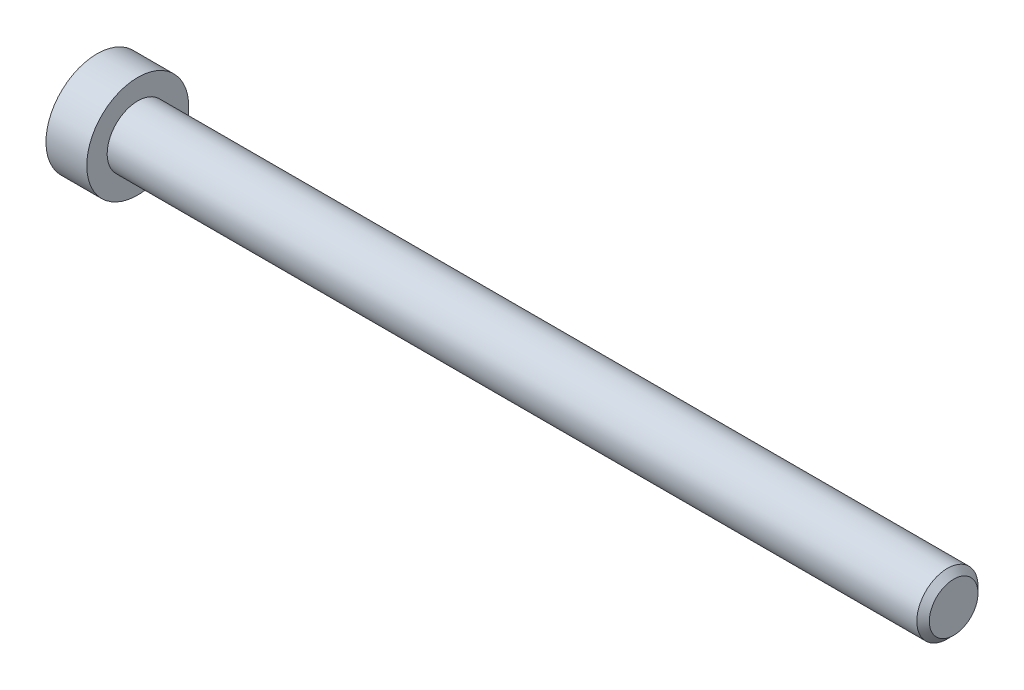
ISO-10303-21;
HEADER;
FILE_DESCRIPTION(('STEP AP214'),'2;1');
FILE_NAME('part.step','',(''),(''),'','','');
FILE_SCHEMA(('AUTOMOTIVE_DESIGN { 1 0 10303 214 1 1 1 1 }'));
ENDSEC;
DATA;
#1=APPLICATION_CONTEXT('core data for automotive mechanical design processes');
#2=APPLICATION_PROTOCOL_DEFINITION('international standard','automotive_design',2000,#1);
#3=PRODUCT_CONTEXT('',#1,'mechanical');
#4=PRODUCT('Part','Part','',(#3));
#5=PRODUCT_RELATED_PRODUCT_CATEGORY('part','',(#4));
#6=PRODUCT_DEFINITION_FORMATION('','',#4);
#7=PRODUCT_DEFINITION_CONTEXT('part definition',#1,'design');
#8=PRODUCT_DEFINITION('design','',#6,#7);
#9=PRODUCT_DEFINITION_SHAPE('','',#8);
#10=(LENGTH_UNIT() NAMED_UNIT(*) SI_UNIT(.MILLI.,.METRE.));
#11=(NAMED_UNIT(*) PLANE_ANGLE_UNIT() SI_UNIT($,.RADIAN.));
#12=(NAMED_UNIT(*) SI_UNIT($,.STERADIAN.) SOLID_ANGLE_UNIT());
#13=UNCERTAINTY_MEASURE_WITH_UNIT(LENGTH_MEASURE(1.E-05),#10,'distance_accuracy_value','');
#14=(GEOMETRIC_REPRESENTATION_CONTEXT(3) GLOBAL_UNCERTAINTY_ASSIGNED_CONTEXT((#13)) GLOBAL_UNIT_ASSIGNED_CONTEXT((#10,
#11,#12)) REPRESENTATION_CONTEXT('',''));
#15=CARTESIAN_POINT('',(0.,0.,0.));
#16=DIRECTION('',(0.,0.,1.));
#17=DIRECTION('',(1.,0.,0.));
#18=AXIS2_PLACEMENT_3D('',#15,#16,#17);
#19=CARTESIAN_POINT('',(0.999999999066858,0.,0.));
#20=DIRECTION('',(-1.,0.,0.));
#21=DIRECTION('',(0.,0.,1.));
#22=AXIS2_PLACEMENT_3D('',#19,#20,#21);
#23=CONICAL_SURFACE('',#22,1.49999999950978,1.04719755001518);
#24=CARTESIAN_POINT('',(1.86602540486547,1.13686837721616E-10,0.));
#25=VERTEX_POINT('',#24);
#26=VERTEX_LOOP('',#25);
#27=FACE_BOUND('',#26,.T.);
#28=CARTESIAN_POINT('',(1.,0.,0.));
#29=DIRECTION('',(1.,0.,0.));
#30=DIRECTION('',(0.,1.,0.));
#31=AXIS2_PLACEMENT_3D('',#28,#29,#30);
#32=CIRCLE('',#31,1.5);
#33=CARTESIAN_POINT('',(1.,1.5,0.));
#34=VERTEX_POINT('',#33);
#35=EDGE_CURVE('E102',#34,#34,#32,.F.);
#36=ORIENTED_EDGE('',*,*,#35,.T.);
#37=EDGE_LOOP('',(#36));
#38=FACE_BOUND('',#37,.T.);
#39=ADVANCED_FACE('F15',(#27,#38),#23,.F.);
#40=CARTESIAN_POINT('',(0.150320631441119,0.,0.));
#41=DIRECTION('',(1.,0.,0.));
#42=DIRECTION('',(0.,1.,0.));
#43=AXIS2_PLACEMENT_3D('',#40,#41,#42);
#44=CYLINDRICAL_SURFACE('',#43,1.5);
#45=ORIENTED_EDGE('',*,*,#35,.F.);
#46=EDGE_LOOP('',(#45));
#47=FACE_BOUND('',#46,.T.);
#48=CARTESIAN_POINT('',(-0.699358736312661,0.,0.));
#49=DIRECTION('',(-1.,0.,0.));
#50=DIRECTION('',(0.,1.,0.));
#51=AXIS2_PLACEMENT_3D('',#48,#49,#50);
#52=CIRCLE('',#51,1.50000000047612);
#53=CARTESIAN_POINT('',(-0.699358736312661,1.50000000047612,0.));
#54=VERTEX_POINT('',#53);
#55=EDGE_CURVE('E83',#54,#54,#52,.T.);
#56=ORIENTED_EDGE('',*,*,#55,.T.);
#57=EDGE_LOOP('',(#56));
#58=FACE_BOUND('',#57,.T.);
#59=ADVANCED_FACE('F152',(#47,#58),#44,.F.);
#60=CARTESIAN_POINT('',(-1.50480384832008,0.,0.));
#61=DIRECTION('',(-1.,0.,0.));
#62=DIRECTION('',(0.,0.,1.));
#63=AXIS2_PLACEMENT_3D('',#60,#61,#62);
#64=CONICAL_SURFACE('',#63,2.89507185334514,1.04719755001073);
#65=ORIENTED_EDGE('',*,*,#55,.F.);
#66=EDGE_LOOP('',(#65));
#67=FACE_BOUND('',#66,.T.);
#68=CARTESIAN_POINT('',(-1.50000000090994,2.50000000020726,1.44337567271138));
#69=CARTESIAN_POINT('',(-1.46336943230046,2.50000000007444,1.31652043381892));
#70=CARTESIAN_POINT('',(-1.4300558472106,2.50000000001995,1.18857018231563));
#71=CARTESIAN_POINT('',(-1.37190798495513,2.49999999998001,0.930454306290177));
#72=CARTESIAN_POINT('',(-1.34709427605387,2.49999999999471,0.800284097041287));
#73=CARTESIAN_POINT('',(-1.30846994921723,2.50000000000517,0.541556812697644));
#74=CARTESIAN_POINT('',(-1.29440223500533,2.50000000000138,0.413039534960997));
#75=CARTESIAN_POINT('',(-1.27761146065546,2.49999999999863,0.155400578725887));
#76=CARTESIAN_POINT('',(-1.27487449296861,2.49999999999966,0.0262798360324409));
#77=CARTESIAN_POINT('',(-1.28058286324248,2.5000000000003,-0.214968419856101));
#78=CARTESIAN_POINT('',(-1.28762660709737,2.50000000000009,-0.327132134317981));
#79=CARTESIAN_POINT('',(-1.30994662654135,2.49999999999992,-0.550728853225329));
#80=CARTESIAN_POINT('',(-1.32523051914313,2.49999999999998,-0.662161084886667));
#81=CARTESIAN_POINT('',(-1.36343729244334,2.50000000000003,-0.886218434121961));
#82=CARTESIAN_POINT('',(-1.38652205359365,2.50000000000002,-0.998815208519759));
#83=CARTESIAN_POINT('',(-1.43891470197747,2.49999999999999,-1.22232986213441));
#84=CARTESIAN_POINT('',(-1.46821028692561,2.49999999999998,-1.33325060262345));
#85=CARTESIAN_POINT('',(-1.50000000104471,2.5,-1.44337567270819));
#86=B_SPLINE_CURVE_WITH_KNOTS('',3,(#68,#69,#70,#71,#72,#73,#74,#75,#76,#77,#78,#79,#80,#81,#82,
#83,#84,#85),.UNSPECIFIED.,.F.,.F.,(4,2,2,2,2,2,2,2,4),(0.,0.39627001456981,0.793492271541644,
1.18088450803327,1.56780111154381,1.9046347285053,2.2417802422547,2.58640202794493,
2.93034746654568),.UNSPECIFIED.);
#87=CARTESIAN_POINT('',(-1.5000000010352,2.4999999998706,1.44337567289935));
#88=VERTEX_POINT('',#87);
#89=CARTESIAN_POINT('',(-1.50000000107833,2.5,-1.44337567282465));
#90=VERTEX_POINT('',#89);
#91=EDGE_CURVE('E18',#88,#90,#86,.T.);
#92=ORIENTED_EDGE('',*,*,#91,.T.);
#93=CARTESIAN_POINT('',(-1.50000000090994,2.49999999987614,-1.4433756732849));
#94=CARTESIAN_POINT('',(-1.46336943230046,2.39014014032572,-1.5068032926161));
#95=CARTESIAN_POINT('',(-1.4300558472106,2.27933197207602,-1.57077841832056));
#96=CARTESIAN_POINT('',(-1.37190798495513,2.05579706629793,-1.69983635629869));
#97=CARTESIAN_POINT('',(-1.34709427605387,1.9430663582798,-1.76492146093587));
#98=CARTESIAN_POINT('',(-1.30846994921723,1.71900195739128,-1.89428510311675));
#99=CARTESIAN_POINT('',(-1.29440223500533,1.60770273004423,-1.95854374198179));
#100=CARTESIAN_POINT('',(-1.27761146065546,1.38458084893874,-2.08736322009696));
#101=CARTESIAN_POINT('',(-1.27487449296861,1.27275900561122,-2.15192359144458));
#102=CARTESIAN_POINT('',(-1.28058286324248,1.06383188739337,-2.27254771938941));
#103=CARTESIAN_POINT('',(-1.28762660709736,0.966695261286451,-2.32862957662016));
#104=CARTESIAN_POINT('',(-1.30994662654135,0.773054822509758,-2.44042793607369));
#105=CARTESIAN_POINT('',(-1.32523051914313,0.676551679090675,-2.49614405190441));
#106=CARTESIAN_POINT('',(-1.36343729244334,0.482512322748331,-2.6081727265221));
#107=CARTESIAN_POINT('',(-1.38652205359365,0.385000655735647,-2.66447111372099));
#108=CARTESIAN_POINT('',(-1.43891470197746,0.191431287587271,-2.77622844052829));
#109=CARTESIAN_POINT('',(-1.4682102869256,0.095371108517176,-2.8316888107728));
#110=CARTESIAN_POINT('',(-1.50000000104471,2.30253922132991E-10,-2.88675134581519));
#111=B_SPLINE_CURVE_WITH_KNOTS('',3,(#93,#94,#95,#96,#97,#98,#99,#100,#101,#102,#103,#104,#105,
#106,#107,#108,#109,#110),.UNSPECIFIED.,.F.,.F.,(4,2,2,2,2,2,2,2,4),(0.,0.39627001456981,
0.793492271541645,1.18088450803327,1.56780111154381,1.9046347285053,2.2417802422547,
2.58640202794493,2.93034746654569),.UNSPECIFIED.);
#112=CARTESIAN_POINT('',(-1.5000000010352,0.,-2.88675134579871));
#113=VERTEX_POINT('',#112);
#114=EDGE_CURVE('E107',#90,#113,#111,.T.);
#115=ORIENTED_EDGE('',*,*,#114,.T.);
#116=CARTESIAN_POINT('',(-1.50000000090994,-3.31114457490151E-10,-2.88675134599628));
#117=CARTESIAN_POINT('',(-1.46336943230046,-0.109859859748714,-2.82332372643503));
#118=CARTESIAN_POINT('',(-1.4300558472106,-0.220668027943928,-2.75934860063619));
#119=CARTESIAN_POINT('',(-1.37190798495513,-0.444202933682073,-2.63029066258887));
#120=CARTESIAN_POINT('',(-1.34709427605387,-0.5569336417149,-2.56520555797716));
#121=CARTESIAN_POINT('',(-1.30846994921723,-0.780998042613884,-2.43584191581439));
#122=CARTESIAN_POINT('',(-1.29440223500533,-0.892297269957147,-2.37158327694279));
#123=CARTESIAN_POINT('',(-1.27761146065546,-1.11541915105988,-2.24276379882285));
#124=CARTESIAN_POINT('',(-1.27487449296861,-1.22724099438844,-2.17820342747702));
#125=CARTESIAN_POINT('',(-1.28058286324248,-1.43616811260693,-2.05757929953331));
#126=CARTESIAN_POINT('',(-1.28762660709736,-1.53330473871363,-2.00149744230218));
#127=CARTESIAN_POINT('',(-1.30994662654135,-1.72694517749016,-1.88969908284837));
#128=CARTESIAN_POINT('',(-1.32523051914313,-1.8234483209093,-1.83398296701775));
#129=CARTESIAN_POINT('',(-1.36343729244334,-2.01748767725169,-1.72195429240014));
#130=CARTESIAN_POINT('',(-1.38652205359365,-2.11499934426437,-1.66565590520123));
#131=CARTESIAN_POINT('',(-1.43891470197746,-2.30856871241272,-1.55389857839388));
#132=CARTESIAN_POINT('',(-1.4682102869256,-2.4046288914828,-1.49843820814935));
#133=CARTESIAN_POINT('',(-1.50000000104471,-2.49999999976975,-1.443375673107));
#134=B_SPLINE_CURVE_WITH_KNOTS('',3,(#116,#117,#118,#119,#120,#121,#122,#123,#124,#125,#126,
#127,#128,#129,#130,#131,#132,#133),.UNSPECIFIED.,.F.,.F.,(4,2,2,2,2,2,2,2,4),(0.,
0.396270014569809,0.793492271541644,1.18088450803327,1.56780111154381,1.9046347285053,
2.2417802422547,2.58640202794493,2.93034746654569),.UNSPECIFIED.);
#135=CARTESIAN_POINT('',(-1.5000000010352,-2.4999999998706,-1.44337567289936));
#136=VERTEX_POINT('',#135);
#137=EDGE_CURVE('E141',#113,#136,#134,.T.);
#138=ORIENTED_EDGE('',*,*,#137,.T.);
#139=CARTESIAN_POINT('',(-1.50000000090994,-2.50000000020726,-1.44337567271139));
#140=CARTESIAN_POINT('',(-1.46336943230046,-2.50000000007444,-1.31652043381893));
#141=CARTESIAN_POINT('',(-1.4300558472106,-2.50000000001995,-1.18857018231564));
#142=CARTESIAN_POINT('',(-1.37190798495513,-2.49999999998,-0.930454306290184));
#143=CARTESIAN_POINT('',(-1.34709427605387,-2.49999999999471,-0.800284097041294));
#144=CARTESIAN_POINT('',(-1.30846994921723,-2.50000000000516,-0.541556812697651));
#145=CARTESIAN_POINT('',(-1.29440223500533,-2.50000000000138,-0.413039534961004));
#146=CARTESIAN_POINT('',(-1.27761146065546,-2.49999999999863,-0.155400578725895));
#147=CARTESIAN_POINT('',(-1.27487449296861,-2.49999999999966,-0.0262798360324483));
#148=CARTESIAN_POINT('',(-1.28058286324248,-2.5000000000003,0.214968419856093));
#149=CARTESIAN_POINT('',(-1.28762660709736,-2.50000000000008,0.327132134317974));
#150=CARTESIAN_POINT('',(-1.30994662654135,-2.49999999999992,0.550728853225323));
#151=CARTESIAN_POINT('',(-1.32523051914313,-2.49999999999998,0.662161084886662));
#152=CARTESIAN_POINT('',(-1.36343729244334,-2.50000000000002,0.886218434121957));
#153=CARTESIAN_POINT('',(-1.38652205359365,-2.50000000000001,0.998815208519755));
#154=CARTESIAN_POINT('',(-1.43891470197746,-2.49999999999999,1.2223298621344));
#155=CARTESIAN_POINT('',(-1.4682102869256,-2.49999999999998,1.33325060262344));
#156=CARTESIAN_POINT('',(-1.50000000104471,-2.5,1.44337567270819));
#157=B_SPLINE_CURVE_WITH_KNOTS('',3,(#139,#140,#141,#142,#143,#144,#145,#146,#147,#148,#149,
#150,#151,#152,#153,#154,#155,#156),.UNSPECIFIED.,.F.,.F.,(4,2,2,2,2,2,2,2,4),(0.,
0.396270014569809,0.793492271541644,1.18088450803327,1.56780111154381,1.9046347285053,
2.2417802422547,2.58640202794493,2.93034746654569),.UNSPECIFIED.);
#158=CARTESIAN_POINT('',(-1.5000000010352,-2.4999999998706,1.44337567289936));
#159=VERTEX_POINT('',#158);
#160=EDGE_CURVE('E165',#136,#159,#157,.T.);
#161=ORIENTED_EDGE('',*,*,#160,.T.);
#162=CARTESIAN_POINT('',(-1.50000000090994,-2.49999999987614,1.44337567328489));
#163=CARTESIAN_POINT('',(-1.46336943230046,-2.39014014032572,1.5068032926161));
#164=CARTESIAN_POINT('',(-1.4300558472106,-2.27933197207602,1.57077841832055));
#165=CARTESIAN_POINT('',(-1.37190798495513,-2.05579706629793,1.69983635629869));
#166=CARTESIAN_POINT('',(-1.34709427605387,-1.9430663582798,1.76492146093586));
#167=CARTESIAN_POINT('',(-1.30846994921723,-1.71900195739128,1.89428510311674));
#168=CARTESIAN_POINT('',(-1.29440223500533,-1.60770273004423,1.95854374198179));
#169=CARTESIAN_POINT('',(-1.27761146065546,-1.38458084893874,2.08736322009696));
#170=CARTESIAN_POINT('',(-1.27487449296861,-1.27275900561122,2.15192359144457));
#171=CARTESIAN_POINT('',(-1.28058286324248,-1.06383188739337,2.2725477193894));
#172=CARTESIAN_POINT('',(-1.28762660709736,-0.966695261286452,2.32862957662015));
#173=CARTESIAN_POINT('',(-1.30994662654135,-0.773054822509759,2.44042793607369));
#174=CARTESIAN_POINT('',(-1.32523051914313,-0.676551679090675,2.49614405190441));
#175=CARTESIAN_POINT('',(-1.36343729244334,-0.482512322748331,2.6081727265221));
#176=CARTESIAN_POINT('',(-1.38652205359365,-0.385000655735646,2.66447111372098));
#177=CARTESIAN_POINT('',(-1.43891470197746,-0.19143128758727,2.77622844052829));
#178=CARTESIAN_POINT('',(-1.4682102869256,-0.0953711085171749,2.8316888107728));
#179=CARTESIAN_POINT('',(-1.50000000104471,-2.30252668835411E-10,2.88675134581519));
#180=B_SPLINE_CURVE_WITH_KNOTS('',3,(#162,#163,#164,#165,#166,#167,#168,#169,#170,#171,#172,
#173,#174,#175,#176,#177,#178,#179),.UNSPECIFIED.,.F.,.F.,(4,2,2,2,2,2,2,2,4),(0.,
0.396270014569809,0.793492271541644,1.18088450803327,1.56780111154381,1.9046347285053,
2.2417802422547,2.58640202794493,2.93034746654569),.UNSPECIFIED.);
#181=CARTESIAN_POINT('',(-1.5000000010352,0.,2.88675134579871));
#182=VERTEX_POINT('',#181);
#183=EDGE_CURVE('E88',#159,#182,#180,.T.);
#184=ORIENTED_EDGE('',*,*,#183,.T.);
#185=CARTESIAN_POINT('',(-1.50000000090994,3.31115352694269E-10,2.88675134599628));
#186=CARTESIAN_POINT('',(-1.46336943230046,0.109859859748716,2.82332372643503));
#187=CARTESIAN_POINT('',(-1.4300558472106,0.220668027943929,2.75934860063619));
#188=CARTESIAN_POINT('',(-1.37190798495513,0.444202933682074,2.63029066258887));
#189=CARTESIAN_POINT('',(-1.34709427605387,0.556933641714901,2.56520555797716));
#190=CARTESIAN_POINT('',(-1.30846994921723,0.780998042613885,2.43584191581439));
#191=CARTESIAN_POINT('',(-1.29440223500533,0.892297269957148,2.37158327694279));
#192=CARTESIAN_POINT('',(-1.27761146065546,1.11541915105988,2.24276379882285));
#193=CARTESIAN_POINT('',(-1.27487449296861,1.22724099438844,2.17820342747702));
#194=CARTESIAN_POINT('',(-1.28058286324248,1.43616811260693,2.05757929953331));
#195=CARTESIAN_POINT('',(-1.28762660709736,1.53330473871363,2.00149744230218));
#196=CARTESIAN_POINT('',(-1.30994662654135,1.72694517749016,1.88969908284836));
#197=CARTESIAN_POINT('',(-1.32523051914313,1.8234483209093,1.83398296701774));
#198=CARTESIAN_POINT('',(-1.36343729244334,2.01748767725169,1.72195429240013));
#199=CARTESIAN_POINT('',(-1.38652205359365,2.11499934426437,1.66565590520122));
#200=CARTESIAN_POINT('',(-1.43891470197746,2.30856871241272,1.55389857839388));
#201=CARTESIAN_POINT('',(-1.4682102869256,2.40462889148281,1.49843820814935));
#202=CARTESIAN_POINT('',(-1.50000000104471,2.49999999976975,1.44337567310699));
#203=B_SPLINE_CURVE_WITH_KNOTS('',3,(#185,#186,#187,#188,#189,#190,#191,#192,#193,#194,#195,
#196,#197,#198,#199,#200,#201,#202),.UNSPECIFIED.,.F.,.F.,(4,2,2,2,2,2,2,2,4),(0.,
0.39627001456981,0.793492271541644,1.18088450803327,1.56780111154381,1.9046347285053,
2.2417802422547,2.58640202794494,2.9303474665457),.UNSPECIFIED.);
#204=EDGE_CURVE('E85',#182,#88,#203,.T.);
#205=ORIENTED_EDGE('',*,*,#204,.T.);
#206=EDGE_LOOP('',(#92,#115,#138,#161,#184,#205));
#207=FACE_BOUND('',#206,.T.);
#208=ADVANCED_FACE('F86',(#67,#207),#64,.F.);
#209=CARTESIAN_POINT('',(-3.99999999999999,2.5,1.44337567297406));
#210=DIRECTION('',(0.,1.,0.));
#211=DIRECTION('',(0.,0.,1.));
#212=AXIS2_PLACEMENT_3D('',#209,#210,#211);
#213=PLANE('',#212);
#214=DIRECTION('',(1.,0.,0.));
#215=VECTOR('',#214,1.);
#216=CARTESIAN_POINT('',(-3.99999999999999,2.5,1.44337567297406));
#217=LINE('',#216,#215);
#218=CARTESIAN_POINT('',(-3.99999999999999,2.5,1.44337567297406));
#219=VERTEX_POINT('',#218);
#220=EDGE_CURVE('E76',#88,#219,#217,.F.);
#221=ORIENTED_EDGE('',*,*,#220,.T.);
#222=DIRECTION('',(0.,0.,1.));
#223=VECTOR('',#222,1.);
#224=CARTESIAN_POINT('',(-3.99999999999999,2.5,0.));
#225=LINE('',#224,#223);
#226=CARTESIAN_POINT('',(-3.99999999999999,2.5,-1.44337567297407));
#227=VERTEX_POINT('',#226);
#228=EDGE_CURVE('E105',#227,#219,#225,.T.);
#229=ORIENTED_EDGE('',*,*,#228,.F.);
#230=DIRECTION('',(1.,0.,0.));
#231=VECTOR('',#230,1.);
#232=CARTESIAN_POINT('',(-3.99999999999999,2.5,-1.44337567297407));
#233=LINE('',#232,#231);
#234=EDGE_CURVE('E79',#227,#90,#233,.T.);
#235=ORIENTED_EDGE('',*,*,#234,.T.);
#236=ORIENTED_EDGE('',*,*,#91,.F.);
#237=EDGE_LOOP('',(#221,#229,#235,#236));
#238=FACE_BOUND('',#237,.T.);
#239=ADVANCED_FACE('F73',(#238),#213,.F.);
#240=CARTESIAN_POINT('',(-3.99999999999999,0.,2.88675134594813));
#241=DIRECTION('',(0.,0.500000000000001,0.866025403784438));
#242=DIRECTION('',(0.,-0.866025403784438,0.500000000000001));
#243=AXIS2_PLACEMENT_3D('',#240,#241,#242);
#244=PLANE('',#243);
#245=DIRECTION('',(1.,0.,0.));
#246=VECTOR('',#245,1.);
#247=CARTESIAN_POINT('',(-3.99999999999999,0.,2.88675134594813));
#248=LINE('',#247,#246);
#249=CARTESIAN_POINT('',(-3.99999999999999,0.,2.88675134594813));
#250=VERTEX_POINT('',#249);
#251=EDGE_CURVE('E91',#182,#250,#248,.F.);
#252=ORIENTED_EDGE('',*,*,#251,.T.);
#253=DIRECTION('',(0.,-0.866025403784438,0.500000000000001));
#254=VECTOR('',#253,1.);
#255=CARTESIAN_POINT('',(-3.99999999999999,2.5,1.44337567297406));
#256=LINE('',#255,#254);
#257=EDGE_CURVE('E94',#219,#250,#256,.T.);
#258=ORIENTED_EDGE('',*,*,#257,.F.);
#259=ORIENTED_EDGE('',*,*,#220,.F.);
#260=ORIENTED_EDGE('',*,*,#204,.F.);
#261=EDGE_LOOP('',(#252,#258,#259,#260));
#262=FACE_BOUND('',#261,.T.);
#263=ADVANCED_FACE('F92',(#262),#244,.F.);
#264=CARTESIAN_POINT('',(-3.99999999999999,-2.5,1.44337567297406));
#265=DIRECTION('',(0.,-0.5,0.866025403784439));
#266=DIRECTION('',(0.,-0.866025403784439,-0.5));
#267=AXIS2_PLACEMENT_3D('',#264,#265,#266);
#268=PLANE('',#267);
#269=DIRECTION('',(1.,0.,0.));
#270=VECTOR('',#269,1.);
#271=CARTESIAN_POINT('',(-3.99999999999999,-2.5,1.44337567297406));
#272=LINE('',#271,#270);
#273=CARTESIAN_POINT('',(-3.99999999999999,-2.5,1.44337567297407));
#274=VERTEX_POINT('',#273);
#275=EDGE_CURVE('E174',#159,#274,#272,.F.);
#276=ORIENTED_EDGE('',*,*,#275,.T.);
#277=DIRECTION('',(0.,-0.866025403784439,-0.5));
#278=VECTOR('',#277,1.);
#279=CARTESIAN_POINT('',(-3.99999999999999,0.,2.88675134594813));
#280=LINE('',#279,#278);
#281=EDGE_CURVE('E118',#250,#274,#280,.T.);
#282=ORIENTED_EDGE('',*,*,#281,.F.);
#283=ORIENTED_EDGE('',*,*,#251,.F.);
#284=ORIENTED_EDGE('',*,*,#183,.F.);
#285=EDGE_LOOP('',(#276,#282,#283,#284));
#286=FACE_BOUND('',#285,.T.);
#287=ADVANCED_FACE('F175',(#286),#268,.F.);
#288=CARTESIAN_POINT('',(-3.99999999999999,-2.5,-1.44337567297406));
#289=DIRECTION('',(0.,-1.,0.));
#290=DIRECTION('',(0.,0.,-1.));
#291=AXIS2_PLACEMENT_3D('',#288,#289,#290);
#292=PLANE('',#291);
#293=DIRECTION('',(1.,0.,0.));
#294=VECTOR('',#293,1.);
#295=CARTESIAN_POINT('',(-3.99999999999999,-2.5,-1.44337567297406));
#296=LINE('',#295,#294);
#297=CARTESIAN_POINT('',(-3.99999999999999,-2.5,-1.44337567297406));
#298=VERTEX_POINT('',#297);
#299=EDGE_CURVE('E226',#136,#298,#296,.F.);
#300=ORIENTED_EDGE('',*,*,#299,.T.);
#301=DIRECTION('',(0.,0.,1.));
#302=VECTOR('',#301,1.);
#303=CARTESIAN_POINT('',(-3.99999999999999,-2.5,0.));
#304=LINE('',#303,#302);
#305=EDGE_CURVE('E115',#274,#298,#304,.F.);
#306=ORIENTED_EDGE('',*,*,#305,.F.);
#307=ORIENTED_EDGE('',*,*,#275,.F.);
#308=ORIENTED_EDGE('',*,*,#160,.F.);
#309=EDGE_LOOP('',(#300,#306,#307,#308));
#310=FACE_BOUND('',#309,.T.);
#311=ADVANCED_FACE('F178',(#310),#292,.F.);
#312=CARTESIAN_POINT('',(-3.99999999999999,0.,-2.88675134594813));
#313=DIRECTION('',(0.,-0.5,-0.866025403784439));
#314=DIRECTION('',(0.,0.866025403784439,-0.5));
#315=AXIS2_PLACEMENT_3D('',#312,#313,#314);
#316=PLANE('',#315);
#317=DIRECTION('',(1.,0.,0.));
#318=VECTOR('',#317,1.);
#319=CARTESIAN_POINT('',(-3.99999999999999,0.,-2.88675134594813));
#320=LINE('',#319,#318);
#321=CARTESIAN_POINT('',(-3.99999999999999,0.,-2.88675134594813));
#322=VERTEX_POINT('',#321);
#323=EDGE_CURVE('E38',#113,#322,#320,.F.);
#324=ORIENTED_EDGE('',*,*,#323,.T.);
#325=DIRECTION('',(0.,0.866025403784439,-0.5));
#326=VECTOR('',#325,1.);
#327=CARTESIAN_POINT('',(-3.99999999999999,-2.5,-1.44337567297406));
#328=LINE('',#327,#326);
#329=EDGE_CURVE('E112',#298,#322,#328,.T.);
#330=ORIENTED_EDGE('',*,*,#329,.F.);
#331=ORIENTED_EDGE('',*,*,#299,.F.);
#332=ORIENTED_EDGE('',*,*,#137,.F.);
#333=EDGE_LOOP('',(#324,#330,#331,#332));
#334=FACE_BOUND('',#333,.T.);
#335=ADVANCED_FACE('F217',(#334),#316,.F.);
#336=CARTESIAN_POINT('',(-3.99999999999999,2.5,-1.44337567297407));
#337=DIRECTION('',(0.,0.5,-0.866025403784439));
#338=DIRECTION('',(0.,0.866025403784439,0.5));
#339=AXIS2_PLACEMENT_3D('',#336,#337,#338);
#340=PLANE('',#339);
#341=ORIENTED_EDGE('',*,*,#234,.F.);
#342=DIRECTION('',(0.,0.866025403784439,0.5));
#343=VECTOR('',#342,1.);
#344=CARTESIAN_POINT('',(-3.99999999999999,0.,-2.88675134594813));
#345=LINE('',#344,#343);
#346=EDGE_CURVE('E108',#322,#227,#345,.T.);
#347=ORIENTED_EDGE('',*,*,#346,.F.);
#348=ORIENTED_EDGE('',*,*,#323,.F.);
#349=ORIENTED_EDGE('',*,*,#114,.F.);
#350=EDGE_LOOP('',(#341,#347,#348,#349));
#351=FACE_BOUND('',#350,.T.);
#352=ADVANCED_FACE('F147',(#351),#340,.F.);
#353=CARTESIAN_POINT('',(-3.99999999999999,3.94337567297406,0.));
#354=DIRECTION('',(-1.,0.,0.));
#355=DIRECTION('',(0.,0.,1.));
#356=AXIS2_PLACEMENT_3D('',#353,#354,#355);
#357=PLANE('',#356);
#358=ORIENTED_EDGE('',*,*,#329,.T.);
#359=ORIENTED_EDGE('',*,*,#346,.T.);
#360=ORIENTED_EDGE('',*,*,#228,.T.);
#361=ORIENTED_EDGE('',*,*,#257,.T.);
#362=ORIENTED_EDGE('',*,*,#281,.T.);
#363=ORIENTED_EDGE('',*,*,#305,.T.);
#364=EDGE_LOOP('',(#358,#359,#360,#361,#362,#363));
#365=FACE_BOUND('',#364,.T.);
#366=CARTESIAN_POINT('',(-3.99999999999999,0.,0.));
#367=DIRECTION('',(1.,0.,0.));
#368=DIRECTION('',(0.,1.,0.));
#369=AXIS2_PLACEMENT_3D('',#366,#367,#368);
#370=CIRCLE('',#369,5.);
#371=CARTESIAN_POINT('',(-3.99999999999999,5.,0.));
#372=VERTEX_POINT('',#371);
#373=EDGE_CURVE('E111',#372,#372,#370,.T.);
#374=ORIENTED_EDGE('',*,*,#373,.F.);
#375=EDGE_LOOP('',(#374));
#376=FACE_BOUND('',#375,.T.);
#377=ADVANCED_FACE('F210',(#365,#376),#357,.T.);
#378=CARTESIAN_POINT('',(-1.99999999999999,0.,0.));
#379=DIRECTION('',(1.,0.,0.));
#380=DIRECTION('',(0.,1.,0.));
#381=AXIS2_PLACEMENT_3D('',#378,#379,#380);
#382=CYLINDRICAL_SURFACE('',#381,5.);
#383=ORIENTED_EDGE('',*,*,#373,.T.);
#384=EDGE_LOOP('',(#383));
#385=FACE_BOUND('',#384,.T.);
#386=CARTESIAN_POINT('',(0.,0.,0.));
#387=DIRECTION('',(1.,0.,0.));
#388=DIRECTION('',(0.,1.,0.));
#389=AXIS2_PLACEMENT_3D('',#386,#387,#388);
#390=CIRCLE('',#389,5.);
#391=CARTESIAN_POINT('',(0.,5.,0.));
#392=VERTEX_POINT('',#391);
#393=EDGE_CURVE('E131',#392,#392,#390,.T.);
#394=ORIENTED_EDGE('',*,*,#393,.F.);
#395=EDGE_LOOP('',(#394));
#396=FACE_BOUND('',#395,.T.);
#397=ADVANCED_FACE('F207',(#385,#396),#382,.T.);
#398=CARTESIAN_POINT('',(80.,1.5,0.));
#399=DIRECTION('',(1.,0.,0.));
#400=DIRECTION('',(0.,0.,-1.));
#401=AXIS2_PLACEMENT_3D('',#398,#399,#400);
#402=PLANE('',#401);
#403=CARTESIAN_POINT('',(80.0000000002683,0.,0.));
#404=DIRECTION('',(-1.,0.,0.));
#405=DIRECTION('',(0.,0.,1.));
#406=AXIS2_PLACEMENT_3D('',#403,#404,#405);
#407=CIRCLE('',#406,2.38655000032395);
#408=CARTESIAN_POINT('',(80.0000000002683,0.,2.38655000032395));
#409=VERTEX_POINT('',#408);
#410=EDGE_CURVE('E128',#409,#409,#407,.T.);
#411=ORIENTED_EDGE('',*,*,#410,.F.);
#412=EDGE_LOOP('',(#411));
#413=FACE_BOUND('',#412,.T.);
#414=ADVANCED_FACE('F203',(#413),#402,.T.);
#415=CARTESIAN_POINT('',(0.,4.,0.));
#416=DIRECTION('',(1.,0.,0.));
#417=DIRECTION('',(0.,0.,-1.));
#418=AXIS2_PLACEMENT_3D('',#415,#416,#417);
#419=PLANE('',#418);
#420=CARTESIAN_POINT('',(0.,0.,0.));
#421=DIRECTION('',(1.,0.,0.));
#422=DIRECTION('',(0.,1.,0.));
#423=AXIS2_PLACEMENT_3D('',#420,#421,#422);
#424=CIRCLE('',#423,3.);
#425=CARTESIAN_POINT('',(0.,3.,0.));
#426=VERTEX_POINT('',#425);
#427=EDGE_CURVE('E29',#426,#426,#424,.T.);
#428=ORIENTED_EDGE('',*,*,#427,.F.);
#429=EDGE_LOOP('',(#428));
#430=FACE_BOUND('',#429,.T.);
#431=ORIENTED_EDGE('',*,*,#393,.T.);
#432=EDGE_LOOP('',(#431));
#433=FACE_BOUND('',#432,.T.);
#434=ADVANCED_FACE('F196',(#430,#433),#419,.T.);
#435=CARTESIAN_POINT('',(79.3865499998674,0.,0.));
#436=DIRECTION('',(-1.,0.,0.));
#437=DIRECTION('',(0.,0.,1.));
#438=AXIS2_PLACEMENT_3D('',#435,#436,#437);
#439=CONICAL_SURFACE('',#438,2.99999999964484,0.785398162517161);
#440=ORIENTED_EDGE('',*,*,#410,.T.);
#441=EDGE_LOOP('',(#440));
#442=FACE_BOUND('',#441,.T.);
#443=CARTESIAN_POINT('',(79.38655,0.,0.));
#444=DIRECTION('',(1.,0.,0.));
#445=DIRECTION('',(0.,1.,0.));
#446=AXIS2_PLACEMENT_3D('',#443,#444,#445);
#447=CIRCLE('',#446,3.);
#448=CARTESIAN_POINT('',(79.38655,3.,0.));
#449=VERTEX_POINT('',#448);
#450=EDGE_CURVE('E9',#449,#449,#447,.F.);
#451=ORIENTED_EDGE('',*,*,#450,.F.);
#452=EDGE_LOOP('',(#451));
#453=FACE_BOUND('',#452,.T.);
#454=ADVANCED_FACE('F189',(#442,#453),#439,.T.);
#455=CARTESIAN_POINT('',(40.,0.,0.));
#456=DIRECTION('',(1.,0.,0.));
#457=DIRECTION('',(0.,1.,0.));
#458=AXIS2_PLACEMENT_3D('',#455,#456,#457);
#459=CYLINDRICAL_SURFACE('',#458,3.);
#460=ORIENTED_EDGE('',*,*,#450,.T.);
#461=EDGE_LOOP('',(#460));
#462=FACE_BOUND('',#461,.T.);
#463=ORIENTED_EDGE('',*,*,#427,.T.);
#464=EDGE_LOOP('',(#463));
#465=FACE_BOUND('',#464,.T.);
#466=ADVANCED_FACE('F187',(#462,#465),#459,.T.);
#467=CLOSED_SHELL('',(#39,#59,#208,#239,#263,#287,#311,#335,#352,#377,#397,#414,#434,#454,#466));
#468=MANIFOLD_SOLID_BREP('B1',#467);
#469=ADVANCED_BREP_SHAPE_REPRESENTATION('',(#18,#468),#14);
#470=SHAPE_DEFINITION_REPRESENTATION(#9,#469);
ENDSEC;
END-ISO-10303-21;
